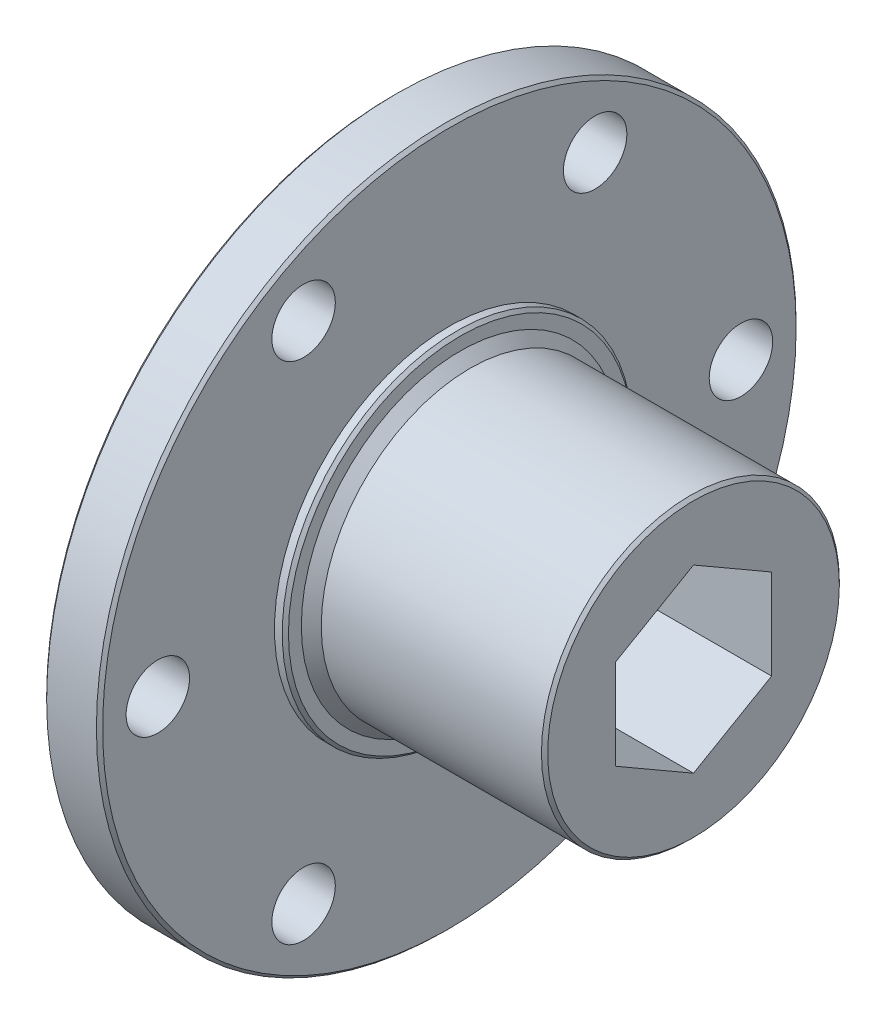
ISO-10303-21;
HEADER;
FILE_DESCRIPTION(('STEP AP214'),'2;1');
FILE_NAME('part.step','',(''),(''),'','','');
FILE_SCHEMA(('AUTOMOTIVE_DESIGN { 1 0 10303 214 1 1 1 1 }'));
ENDSEC;
DATA;
#1=APPLICATION_CONTEXT('core data for automotive mechanical design processes');
#2=APPLICATION_PROTOCOL_DEFINITION('international standard','automotive_design',2000,#1);
#3=PRODUCT_CONTEXT('',#1,'mechanical');
#4=PRODUCT('Part','Part','',(#3));
#5=PRODUCT_RELATED_PRODUCT_CATEGORY('part','',(#4));
#6=PRODUCT_DEFINITION_FORMATION('','',#4);
#7=PRODUCT_DEFINITION_CONTEXT('part definition',#1,'design');
#8=PRODUCT_DEFINITION('design','',#6,#7);
#9=PRODUCT_DEFINITION_SHAPE('','',#8);
#10=(LENGTH_UNIT() NAMED_UNIT(*) SI_UNIT(.MILLI.,.METRE.));
#11=(NAMED_UNIT(*) PLANE_ANGLE_UNIT() SI_UNIT($,.RADIAN.));
#12=(NAMED_UNIT(*) SI_UNIT($,.STERADIAN.) SOLID_ANGLE_UNIT());
#13=UNCERTAINTY_MEASURE_WITH_UNIT(LENGTH_MEASURE(1.E-05),#10,'distance_accuracy_value','');
#14=(GEOMETRIC_REPRESENTATION_CONTEXT(3) GLOBAL_UNCERTAINTY_ASSIGNED_CONTEXT((#13)) GLOBAL_UNIT_ASSIGNED_CONTEXT((#10,
#11,#12)) REPRESENTATION_CONTEXT('',''));
#15=CARTESIAN_POINT('',(0.,0.,0.));
#16=DIRECTION('',(0.,0.,1.));
#17=DIRECTION('',(1.,0.,0.));
#18=AXIS2_PLACEMENT_3D('',#15,#16,#17);
#19=CARTESIAN_POINT('',(-13.9240662460568,0.,0.));
#20=DIRECTION('',(-1.,0.,0.));
#21=DIRECTION('',(0.,0.,1.));
#22=AXIS2_PLACEMENT_3D('',#19,#20,#21);
#23=CYLINDRICAL_SURFACE('',#22,28.575);
#24=CARTESIAN_POINT('',(-18.2420662460566,0.,0.));
#25=DIRECTION('',(-1.,0.,0.));
#26=DIRECTION('',(0.,0.,1.));
#27=AXIS2_PLACEMENT_3D('',#24,#25,#26);
#28=CIRCLE('',#27,28.575);
#29=CARTESIAN_POINT('',(-18.2420662460566,0.,28.575));
#30=VERTEX_POINT('',#29);
#31=EDGE_CURVE('E177',#30,#30,#28,.F.);
#32=ORIENTED_EDGE('',*,*,#31,.T.);
#33=EDGE_LOOP('',(#32));
#34=FACE_BOUND('',#33,.T.);
#35=CARTESIAN_POINT('',(-14.1780662460569,0.,0.));
#36=DIRECTION('',(1.,0.,0.));
#37=DIRECTION('',(0.,0.,-1.));
#38=AXIS2_PLACEMENT_3D('',#35,#36,#37);
#39=CIRCLE('',#38,28.575);
#40=CARTESIAN_POINT('',(-14.1780662460569,0.,-28.575));
#41=VERTEX_POINT('',#40);
#42=EDGE_CURVE('E174',#41,#41,#39,.F.);
#43=ORIENTED_EDGE('',*,*,#42,.T.);
#44=EDGE_LOOP('',(#43));
#45=FACE_BOUND('',#44,.T.);
#46=ADVANCED_FACE('F35',(#34,#45),#23,.T.);
#47=CARTESIAN_POINT('',(-13.9240662460568,28.575,0.));
#48=DIRECTION('',(1.,0.,0.));
#49=DIRECTION('',(0.,0.,-1.));
#50=AXIS2_PLACEMENT_3D('',#47,#48,#49);
#51=PLANE('',#50);
#52=CARTESIAN_POINT('',(-13.9240662460568,0.,0.));
#53=DIRECTION('',(1.,0.,0.));
#54=DIRECTION('',(0.,0.,-1.));
#55=AXIS2_PLACEMENT_3D('',#52,#53,#54);
#56=CIRCLE('',#55,28.3209999999999);
#57=CARTESIAN_POINT('',(-13.9240662460568,0.,-28.3209999999999));
#58=VERTEX_POINT('',#57);
#59=EDGE_CURVE('E11',#58,#58,#56,.T.);
#60=ORIENTED_EDGE('',*,*,#59,.T.);
#61=EDGE_LOOP('',(#60));
#62=FACE_BOUND('',#61,.T.);
#63=CARTESIAN_POINT('',(-13.9240662460568,20.6222299276169,11.90625));
#64=DIRECTION('',(1.,0.,0.));
#65=DIRECTION('',(0.,0.,-1.));
#66=AXIS2_PLACEMENT_3D('',#63,#64,#65);
#67=CIRCLE('',#66,2.59080000000003);
#68=CARTESIAN_POINT('',(-13.9240662460568,20.6222299276169,9.31544999999998));
#69=VERTEX_POINT('',#68);
#70=EDGE_CURVE('E155',#69,#69,#67,.T.);
#71=ORIENTED_EDGE('',*,*,#70,.F.);
#72=EDGE_LOOP('',(#71));
#73=FACE_BOUND('',#72,.T.);
#74=CARTESIAN_POINT('',(-13.9240662460568,0.,-23.8125));
#75=DIRECTION('',(1.,0.,0.));
#76=DIRECTION('',(0.,0.,-1.));
#77=AXIS2_PLACEMENT_3D('',#74,#75,#76);
#78=CIRCLE('',#77,2.59080000000003);
#79=CARTESIAN_POINT('',(-13.9240662460568,0.,-26.4033));
#80=VERTEX_POINT('',#79);
#81=EDGE_CURVE('E329',#80,#80,#78,.T.);
#82=ORIENTED_EDGE('',*,*,#81,.F.);
#83=EDGE_LOOP('',(#82));
#84=FACE_BOUND('',#83,.T.);
#85=CARTESIAN_POINT('',(-13.9240662460568,-20.622229927617,11.9062499999999));
#86=DIRECTION('',(1.,0.,0.));
#87=DIRECTION('',(0.,0.,-1.));
#88=AXIS2_PLACEMENT_3D('',#85,#86,#87);
#89=CIRCLE('',#88,2.59080000000003);
#90=CARTESIAN_POINT('',(-13.9240662460568,-20.622229927617,9.31544999999992));
#91=VERTEX_POINT('',#90);
#92=EDGE_CURVE('E333',#91,#91,#89,.T.);
#93=ORIENTED_EDGE('',*,*,#92,.F.);
#94=EDGE_LOOP('',(#93));
#95=FACE_BOUND('',#94,.T.);
#96=CARTESIAN_POINT('',(-13.9240662460568,-20.6222299276169,-11.90625));
#97=DIRECTION('',(1.,0.,0.));
#98=DIRECTION('',(0.,0.,-1.));
#99=AXIS2_PLACEMENT_3D('',#96,#97,#98);
#100=CIRCLE('',#99,2.59080000000003);
#101=CARTESIAN_POINT('',(-13.9240662460568,-20.6222299276169,-14.4970500000001));
#102=VERTEX_POINT('',#101);
#103=EDGE_CURVE('E337',#102,#102,#100,.T.);
#104=ORIENTED_EDGE('',*,*,#103,.F.);
#105=EDGE_LOOP('',(#104));
#106=FACE_BOUND('',#105,.T.);
#107=CARTESIAN_POINT('',(-13.9240662460568,20.622229927617,-11.90625));
#108=DIRECTION('',(1.,0.,0.));
#109=DIRECTION('',(0.,0.,-1.));
#110=AXIS2_PLACEMENT_3D('',#107,#108,#109);
#111=CIRCLE('',#110,2.59080000000003);
#112=CARTESIAN_POINT('',(-13.9240662460568,20.622229927617,-14.49705));
#113=VERTEX_POINT('',#112);
#114=EDGE_CURVE('E341',#113,#113,#111,.T.);
#115=ORIENTED_EDGE('',*,*,#114,.F.);
#116=EDGE_LOOP('',(#115));
#117=FACE_BOUND('',#116,.T.);
#118=CARTESIAN_POINT('',(-13.9240662460568,0.,23.8125));
#119=DIRECTION('',(1.,0.,0.));
#120=DIRECTION('',(0.,0.,-1.));
#121=AXIS2_PLACEMENT_3D('',#118,#119,#120);
#122=CIRCLE('',#121,2.59080000000003);
#123=CARTESIAN_POINT('',(-13.9240662460568,0.,21.2217));
#124=VERTEX_POINT('',#123);
#125=EDGE_CURVE('E112',#124,#124,#122,.T.);
#126=ORIENTED_EDGE('',*,*,#125,.F.);
#127=EDGE_LOOP('',(#126));
#128=FACE_BOUND('',#127,.T.);
#129=CARTESIAN_POINT('',(-13.9240662460568,0.,0.));
#130=DIRECTION('',(1.,0.,0.));
#131=DIRECTION('',(0.,0.,-1.));
#132=AXIS2_PLACEMENT_3D('',#129,#130,#131);
#133=CIRCLE('',#132,14.2875);
#134=CARTESIAN_POINT('',(-13.9240662460568,0.,-14.2875));
#135=VERTEX_POINT('',#134);
#136=EDGE_CURVE('E151',#135,#135,#133,.T.);
#137=ORIENTED_EDGE('',*,*,#136,.F.);
#138=EDGE_LOOP('',(#137));
#139=FACE_BOUND('',#138,.T.);
#140=ADVANCED_FACE('F212',(#62,#73,#84,#95,#106,#117,#128,#139),#51,.T.);
#141=CARTESIAN_POINT('',(-18.4960662460568,0.,0.));
#142=DIRECTION('',(-1.,0.,0.));
#143=DIRECTION('',(0.,0.,1.));
#144=AXIS2_PLACEMENT_3D('',#141,#142,#143);
#145=PLANE('',#144);
#146=CARTESIAN_POINT('',(-18.4960662460568,0.,0.));
#147=DIRECTION('',(-1.,0.,0.));
#148=DIRECTION('',(0.,0.,1.));
#149=AXIS2_PLACEMENT_3D('',#146,#147,#148);
#150=CIRCLE('',#149,28.3209999999999);
#151=CARTESIAN_POINT('',(-18.4960662460568,0.,28.3209999999999));
#152=VERTEX_POINT('',#151);
#153=EDGE_CURVE('E171',#152,#152,#150,.T.);
#154=ORIENTED_EDGE('',*,*,#153,.T.);
#155=EDGE_LOOP('',(#154));
#156=FACE_BOUND('',#155,.T.);
#157=CARTESIAN_POINT('',(-18.4960662460568,20.6222299276169,11.90625));
#158=DIRECTION('',(-1.,0.,0.));
#159=DIRECTION('',(0.,0.,1.));
#160=AXIS2_PLACEMENT_3D('',#157,#158,#159);
#161=CIRCLE('',#160,2.59080000000003);
#162=CARTESIAN_POINT('',(-18.4960662460568,20.6222299276169,14.49705));
#163=VERTEX_POINT('',#162);
#164=EDGE_CURVE('E159',#163,#163,#161,.T.);
#165=ORIENTED_EDGE('',*,*,#164,.F.);
#166=EDGE_LOOP('',(#165));
#167=FACE_BOUND('',#166,.T.);
#168=CARTESIAN_POINT('',(-18.4960662460568,0.,-23.8125));
#169=DIRECTION('',(-1.,0.,0.));
#170=DIRECTION('',(0.,0.,1.));
#171=AXIS2_PLACEMENT_3D('',#168,#169,#170);
#172=CIRCLE('',#171,2.59080000000003);
#173=CARTESIAN_POINT('',(-18.4960662460568,0.,-21.2217));
#174=VERTEX_POINT('',#173);
#175=EDGE_CURVE('E158',#174,#174,#172,.T.);
#176=ORIENTED_EDGE('',*,*,#175,.F.);
#177=EDGE_LOOP('',(#176));
#178=FACE_BOUND('',#177,.T.);
#179=CARTESIAN_POINT('',(-18.4960662460568,-20.622229927617,11.9062499999999));
#180=DIRECTION('',(-1.,0.,0.));
#181=DIRECTION('',(0.,0.,1.));
#182=AXIS2_PLACEMENT_3D('',#179,#180,#181);
#183=CIRCLE('',#182,2.59080000000003);
#184=CARTESIAN_POINT('',(-18.4960662460568,-20.622229927617,14.49705));
#185=VERTEX_POINT('',#184);
#186=EDGE_CURVE('E252',#185,#185,#183,.T.);
#187=ORIENTED_EDGE('',*,*,#186,.F.);
#188=EDGE_LOOP('',(#187));
#189=FACE_BOUND('',#188,.T.);
#190=CARTESIAN_POINT('',(-18.4960662460568,-20.6222299276169,-11.90625));
#191=DIRECTION('',(-1.,0.,0.));
#192=DIRECTION('',(0.,0.,1.));
#193=AXIS2_PLACEMENT_3D('',#190,#191,#192);
#194=CIRCLE('',#193,2.59080000000003);
#195=CARTESIAN_POINT('',(-18.4960662460568,-20.6222299276169,-9.31545000000002));
#196=VERTEX_POINT('',#195);
#197=EDGE_CURVE('E256',#196,#196,#194,.T.);
#198=ORIENTED_EDGE('',*,*,#197,.F.);
#199=EDGE_LOOP('',(#198));
#200=FACE_BOUND('',#199,.T.);
#201=CARTESIAN_POINT('',(-18.4960662460568,20.622229927617,-11.90625));
#202=DIRECTION('',(-1.,0.,0.));
#203=DIRECTION('',(0.,0.,1.));
#204=AXIS2_PLACEMENT_3D('',#201,#202,#203);
#205=CIRCLE('',#204,2.59080000000003);
#206=CARTESIAN_POINT('',(-18.4960662460568,20.622229927617,-9.31544999999995));
#207=VERTEX_POINT('',#206);
#208=EDGE_CURVE('E260',#207,#207,#205,.T.);
#209=ORIENTED_EDGE('',*,*,#208,.F.);
#210=EDGE_LOOP('',(#209));
#211=FACE_BOUND('',#210,.T.);
#212=CARTESIAN_POINT('',(-18.4960662460568,0.,23.8125));
#213=DIRECTION('',(-1.,0.,0.));
#214=DIRECTION('',(0.,0.,1.));
#215=AXIS2_PLACEMENT_3D('',#212,#213,#214);
#216=CIRCLE('',#215,2.59080000000003);
#217=CARTESIAN_POINT('',(-18.4960662460568,0.,26.4033));
#218=VERTEX_POINT('',#217);
#219=EDGE_CURVE('E264',#218,#218,#216,.T.);
#220=ORIENTED_EDGE('',*,*,#219,.F.);
#221=EDGE_LOOP('',(#220));
#222=FACE_BOUND('',#221,.T.);
#223=CARTESIAN_POINT('',(-18.4960662460568,0.,0.));
#224=DIRECTION('',(-1.,0.,0.));
#225=DIRECTION('',(0.,0.,1.));
#226=AXIS2_PLACEMENT_3D('',#223,#224,#225);
#227=CIRCLE('',#226,14.2875);
#228=CARTESIAN_POINT('',(-18.4960662460568,0.,14.2875));
#229=VERTEX_POINT('',#228);
#230=EDGE_CURVE('E135',#229,#229,#227,.T.);
#231=ORIENTED_EDGE('',*,*,#230,.F.);
#232=EDGE_LOOP('',(#231));
#233=FACE_BOUND('',#232,.T.);
#234=ADVANCED_FACE('F218',(#156,#167,#178,#189,#200,#211,#222,#233),#145,.T.);
#235=CARTESIAN_POINT('',(-13.0350662460568,0.,0.));
#236=DIRECTION('',(-1.,0.,0.));
#237=DIRECTION('',(0.,0.,1.));
#238=AXIS2_PLACEMENT_3D('',#235,#236,#237);
#239=CYLINDRICAL_SURFACE('',#238,14.2875);
#240=CARTESIAN_POINT('',(-13.2890662460569,0.,0.));
#241=DIRECTION('',(1.,0.,0.));
#242=DIRECTION('',(0.,0.,-1.));
#243=AXIS2_PLACEMENT_3D('',#240,#241,#242);
#244=CIRCLE('',#243,14.2875);
#245=CARTESIAN_POINT('',(-13.2890662460569,0.,-14.2875));
#246=VERTEX_POINT('',#245);
#247=EDGE_CURVE('E43',#246,#246,#244,.F.);
#248=ORIENTED_EDGE('',*,*,#247,.T.);
#249=EDGE_LOOP('',(#248));
#250=FACE_BOUND('',#249,.T.);
#251=ORIENTED_EDGE('',*,*,#136,.T.);
#252=EDGE_LOOP('',(#251));
#253=FACE_BOUND('',#252,.T.);
#254=ADVANCED_FACE('F185',(#250,#253),#239,.T.);
#255=CARTESIAN_POINT('',(-13.0350662460568,0.,0.));
#256=DIRECTION('',(1.,0.,0.));
#257=DIRECTION('',(0.,0.,-1.));
#258=AXIS2_PLACEMENT_3D('',#255,#256,#257);
#259=PLANE('',#258);
#260=CARTESIAN_POINT('',(-13.0350662460568,0.,0.));
#261=DIRECTION('',(1.,0.,0.));
#262=DIRECTION('',(0.,0.,-1.));
#263=AXIS2_PLACEMENT_3D('',#260,#261,#262);
#264=CIRCLE('',#263,14.0334999999999);
#265=CARTESIAN_POINT('',(-13.0350662460568,0.,-14.0334999999999));
#266=VERTEX_POINT('',#265);
#267=EDGE_CURVE('E180',#266,#266,#264,.T.);
#268=ORIENTED_EDGE('',*,*,#267,.T.);
#269=EDGE_LOOP('',(#268));
#270=FACE_BOUND('',#269,.T.);
#271=CARTESIAN_POINT('',(-13.0350662460568,0.,0.));
#272=DIRECTION('',(1.,0.,0.));
#273=DIRECTION('',(0.,0.,-1.));
#274=AXIS2_PLACEMENT_3D('',#271,#272,#273);
#275=CIRCLE('',#274,12.9794);
#276=CARTESIAN_POINT('',(-13.0350662460568,0.,-12.9794));
#277=VERTEX_POINT('',#276);
#278=EDGE_CURVE('E145',#277,#277,#275,.T.);
#279=ORIENTED_EDGE('',*,*,#278,.F.);
#280=EDGE_LOOP('',(#279));
#281=FACE_BOUND('',#280,.T.);
#282=ADVANCED_FACE('F194',(#270,#281),#259,.T.);
#283=CARTESIAN_POINT('',(-13.0350662460568,0.,0.));
#284=DIRECTION('',(-1.,0.,0.));
#285=DIRECTION('',(0.,0.,-1.));
#286=AXIS2_PLACEMENT_3D('',#283,#284,#285);
#287=CONICAL_SURFACE('',#286,12.9794,0.785398163397434);
#288=CARTESIAN_POINT('',(-12.2222662460567,0.,0.));
#289=DIRECTION('',(1.,0.,0.));
#290=DIRECTION('',(0.,0.,-1.));
#291=AXIS2_PLACEMENT_3D('',#288,#289,#290);
#292=CIRCLE('',#291,12.1666);
#293=CARTESIAN_POINT('',(-12.2222662460567,0.,-12.1666));
#294=VERTEX_POINT('',#293);
#295=EDGE_CURVE('E148',#294,#294,#292,.T.);
#296=ORIENTED_EDGE('',*,*,#295,.F.);
#297=EDGE_LOOP('',(#296));
#298=FACE_BOUND('',#297,.T.);
#299=ORIENTED_EDGE('',*,*,#278,.T.);
#300=EDGE_LOOP('',(#299));
#301=FACE_BOUND('',#300,.T.);
#302=ADVANCED_FACE('F197',(#298,#301),#287,.T.);
#303=CARTESIAN_POINT('',(6.01493375394323,0.,0.));
#304=DIRECTION('',(-1.,0.,0.));
#305=DIRECTION('',(0.,0.,1.));
#306=AXIS2_PLACEMENT_3D('',#303,#304,#305);
#307=CYLINDRICAL_SURFACE('',#306,12.1666);
#308=CARTESIAN_POINT('',(5.76093375394317,0.,0.));
#309=DIRECTION('',(1.,0.,0.));
#310=DIRECTION('',(0.,0.,-1.));
#311=AXIS2_PLACEMENT_3D('',#308,#309,#310);
#312=CIRCLE('',#311,12.1666);
#313=CARTESIAN_POINT('',(5.76093375394317,0.,-12.1666));
#314=VERTEX_POINT('',#313);
#315=EDGE_CURVE('E168',#314,#314,#312,.F.);
#316=ORIENTED_EDGE('',*,*,#315,.T.);
#317=EDGE_LOOP('',(#316));
#318=FACE_BOUND('',#317,.T.);
#319=ORIENTED_EDGE('',*,*,#295,.T.);
#320=EDGE_LOOP('',(#319));
#321=FACE_BOUND('',#320,.T.);
#322=ADVANCED_FACE('F202',(#318,#321),#307,.T.);
#323=CARTESIAN_POINT('',(6.01493375394323,0.,0.));
#324=DIRECTION('',(1.,0.,0.));
#325=DIRECTION('',(0.,0.,-1.));
#326=AXIS2_PLACEMENT_3D('',#323,#324,#325);
#327=PLANE('',#326);
#328=CARTESIAN_POINT('',(6.01493375394323,0.,0.));
#329=DIRECTION('',(1.,0.,0.));
#330=DIRECTION('',(0.,0.,-1.));
#331=AXIS2_PLACEMENT_3D('',#328,#329,#330);
#332=CIRCLE('',#331,11.9125999999999);
#333=CARTESIAN_POINT('',(6.01493375394323,0.,-11.9125999999999));
#334=VERTEX_POINT('',#333);
#335=EDGE_CURVE('E165',#334,#334,#332,.T.);
#336=ORIENTED_EDGE('',*,*,#335,.T.);
#337=EDGE_LOOP('',(#336));
#338=FACE_BOUND('',#337,.T.);
#339=DIRECTION('',(0.,0.500000000000001,-0.866025403784438));
#340=VECTOR('',#339,1.);
#341=CARTESIAN_POINT('',(6.01493375394323,3.68081890619155,6.3754));
#342=LINE('',#341,#340);
#343=CARTESIAN_POINT('',(6.01493375394323,3.68081890619155,6.3754));
#344=VERTEX_POINT('',#343);
#345=CARTESIAN_POINT('',(6.01493375394323,7.3616578123831,0.));
#346=VERTEX_POINT('',#345);
#347=EDGE_CURVE('E90',#344,#346,#342,.T.);
#348=ORIENTED_EDGE('',*,*,#347,.T.);
#349=DIRECTION('',(0.,-0.500000000000001,-0.866025403784438));
#350=VECTOR('',#349,1.);
#351=CARTESIAN_POINT('',(6.01493375394323,7.3616578123831,0.));
#352=LINE('',#351,#350);
#353=CARTESIAN_POINT('',(6.01493375394323,3.68081890619154,-6.37539999999999));
#354=VERTEX_POINT('',#353);
#355=EDGE_CURVE('E99',#346,#354,#352,.T.);
#356=ORIENTED_EDGE('',*,*,#355,.T.);
#357=DIRECTION('',(0.,-1.,0.));
#358=VECTOR('',#357,1.);
#359=CARTESIAN_POINT('',(6.01493375394323,3.68081890619155,-6.37539999999999));
#360=LINE('',#359,#358);
#361=CARTESIAN_POINT('',(6.01493375394323,-3.68085890619153,-6.37539999999999));
#362=VERTEX_POINT('',#361);
#363=EDGE_CURVE('E50',#354,#362,#360,.T.);
#364=ORIENTED_EDGE('',*,*,#363,.T.);
#365=DIRECTION('',(0.,-0.500000000000001,0.866025403784438));
#366=VECTOR('',#365,1.);
#367=CARTESIAN_POINT('',(6.01493375394323,-3.68085890619153,-6.37539999999999));
#368=LINE('',#367,#366);
#369=CARTESIAN_POINT('',(6.01493375394323,-7.36169781238308,0.));
#370=VERTEX_POINT('',#369);
#371=EDGE_CURVE('E116',#362,#370,#368,.T.);
#372=ORIENTED_EDGE('',*,*,#371,.T.);
#373=DIRECTION('',(0.,0.500000000000001,0.866025403784438));
#374=VECTOR('',#373,1.);
#375=CARTESIAN_POINT('',(6.01493375394323,-7.36169781238308,0.));
#376=LINE('',#375,#374);
#377=CARTESIAN_POINT('',(6.01493375394323,-3.68085890619153,6.3754));
#378=VERTEX_POINT('',#377);
#379=EDGE_CURVE('E119',#370,#378,#376,.T.);
#380=ORIENTED_EDGE('',*,*,#379,.T.);
#381=DIRECTION('',(0.,1.,0.));
#382=VECTOR('',#381,1.);
#383=CARTESIAN_POINT('',(6.01493375394323,-3.68085890619153,6.3754));
#384=LINE('',#383,#382);
#385=EDGE_CURVE('E96',#378,#344,#384,.T.);
#386=ORIENTED_EDGE('',*,*,#385,.T.);
#387=EDGE_LOOP('',(#348,#356,#364,#372,#380,#386));
#388=FACE_BOUND('',#387,.T.);
#389=ADVANCED_FACE('F103',(#338,#388),#327,.T.);
#390=CARTESIAN_POINT('',(-19.3850662460568,0.,0.));
#391=DIRECTION('',(1.,0.,0.));
#392=DIRECTION('',(0.,0.,-1.));
#393=AXIS2_PLACEMENT_3D('',#390,#391,#392);
#394=CYLINDRICAL_SURFACE('',#393,14.2875);
#395=CARTESIAN_POINT('',(-19.1310662460567,0.,0.));
#396=DIRECTION('',(-1.,0.,0.));
#397=DIRECTION('',(0.,0.,1.));
#398=AXIS2_PLACEMENT_3D('',#395,#396,#397);
#399=CIRCLE('',#398,14.2875);
#400=CARTESIAN_POINT('',(-19.1310662460567,0.,14.2875));
#401=VERTEX_POINT('',#400);
#402=EDGE_CURVE('E162',#401,#401,#399,.F.);
#403=ORIENTED_EDGE('',*,*,#402,.T.);
#404=EDGE_LOOP('',(#403));
#405=FACE_BOUND('',#404,.T.);
#406=ORIENTED_EDGE('',*,*,#230,.T.);
#407=EDGE_LOOP('',(#406));
#408=FACE_BOUND('',#407,.T.);
#409=ADVANCED_FACE('F267',(#405,#408),#394,.T.);
#410=CARTESIAN_POINT('',(-19.3850662460568,0.,0.));
#411=DIRECTION('',(-1.,0.,0.));
#412=DIRECTION('',(0.,0.,1.));
#413=AXIS2_PLACEMENT_3D('',#410,#411,#412);
#414=PLANE('',#413);
#415=CARTESIAN_POINT('',(-19.3850662460568,0.,0.));
#416=DIRECTION('',(-1.,0.,0.));
#417=DIRECTION('',(0.,0.,1.));
#418=AXIS2_PLACEMENT_3D('',#415,#416,#417);
#419=CIRCLE('',#418,14.0334999999999);
#420=CARTESIAN_POINT('',(-19.3850662460568,0.,14.0334999999999));
#421=VERTEX_POINT('',#420);
#422=EDGE_CURVE('E154',#421,#421,#419,.T.);
#423=ORIENTED_EDGE('',*,*,#422,.T.);
#424=EDGE_LOOP('',(#423));
#425=FACE_BOUND('',#424,.T.);
#426=DIRECTION('',(0.,0.500000000000001,-0.866025403784438));
#427=VECTOR('',#426,1.);
#428=CARTESIAN_POINT('',(-19.3850662460568,3.68081890619155,6.3754));
#429=LINE('',#428,#427);
#430=CARTESIAN_POINT('',(-19.3850662460568,3.68081890619155,6.3754));
#431=VERTEX_POINT('',#430);
#432=CARTESIAN_POINT('',(-19.3850662460568,7.36165781238309,0.));
#433=VERTEX_POINT('',#432);
#434=EDGE_CURVE('E58',#431,#433,#429,.T.);
#435=ORIENTED_EDGE('',*,*,#434,.F.);
#436=DIRECTION('',(0.,1.,0.));
#437=VECTOR('',#436,1.);
#438=CARTESIAN_POINT('',(-19.3850662460568,-3.68085890619153,6.3754));
#439=LINE('',#438,#437);
#440=CARTESIAN_POINT('',(-19.3850662460568,-3.68085890619153,6.3754));
#441=VERTEX_POINT('',#440);
#442=EDGE_CURVE('E106',#441,#431,#439,.T.);
#443=ORIENTED_EDGE('',*,*,#442,.F.);
#444=DIRECTION('',(0.,0.500000000000001,0.866025403784438));
#445=VECTOR('',#444,1.);
#446=CARTESIAN_POINT('',(-19.3850662460568,-7.36169781238308,0.));
#447=LINE('',#446,#445);
#448=CARTESIAN_POINT('',(-19.3850662460568,-7.36169781238308,0.));
#449=VERTEX_POINT('',#448);
#450=EDGE_CURVE('E109',#449,#441,#447,.T.);
#451=ORIENTED_EDGE('',*,*,#450,.F.);
#452=DIRECTION('',(0.,-0.500000000000001,0.866025403784438));
#453=VECTOR('',#452,1.);
#454=CARTESIAN_POINT('',(-19.3850662460568,-3.68085890619153,-6.37539999999999));
#455=LINE('',#454,#453);
#456=CARTESIAN_POINT('',(-19.3850662460568,-3.68085890619153,-6.37539999999999));
#457=VERTEX_POINT('',#456);
#458=EDGE_CURVE('E128',#457,#449,#455,.T.);
#459=ORIENTED_EDGE('',*,*,#458,.F.);
#460=DIRECTION('',(0.,-1.,0.));
#461=VECTOR('',#460,1.);
#462=CARTESIAN_POINT('',(-19.3850662460568,3.68081890619155,-6.37539999999999));
#463=LINE('',#462,#461);
#464=CARTESIAN_POINT('',(-19.3850662460568,3.68081890619155,-6.37539999999999));
#465=VERTEX_POINT('',#464);
#466=EDGE_CURVE('E125',#465,#457,#463,.T.);
#467=ORIENTED_EDGE('',*,*,#466,.F.);
#468=DIRECTION('',(0.,-0.500000000000001,-0.866025403784438));
#469=VECTOR('',#468,1.);
#470=CARTESIAN_POINT('',(-19.3850662460568,7.3616578123831,0.));
#471=LINE('',#470,#469);
#472=EDGE_CURVE('E123',#433,#465,#471,.T.);
#473=ORIENTED_EDGE('',*,*,#472,.F.);
#474=EDGE_LOOP('',(#435,#443,#451,#459,#467,#473));
#475=FACE_BOUND('',#474,.T.);
#476=ADVANCED_FACE('F269',(#425,#475),#414,.T.);
#477=CARTESIAN_POINT('',(6.01493375394323,3.68081890619155,6.3754));
#478=DIRECTION('',(0.,0.866025403784438,0.500000000000001));
#479=DIRECTION('',(0.,-0.500000000000001,0.866025403784438));
#480=AXIS2_PLACEMENT_3D('',#477,#478,#479);
#481=PLANE('',#480);
#482=ORIENTED_EDGE('',*,*,#434,.T.);
#483=DIRECTION('',(-1.,0.,0.));
#484=VECTOR('',#483,1.);
#485=CARTESIAN_POINT('',(6.01493375394323,7.3616578123831,0.));
#486=LINE('',#485,#484);
#487=EDGE_CURVE('E86',#346,#433,#486,.T.);
#488=ORIENTED_EDGE('',*,*,#487,.F.);
#489=ORIENTED_EDGE('',*,*,#347,.F.);
#490=DIRECTION('',(-1.,0.,0.));
#491=VECTOR('',#490,1.);
#492=CARTESIAN_POINT('',(6.01493375394323,3.68081890619155,6.3754));
#493=LINE('',#492,#491);
#494=EDGE_CURVE('E133',#344,#431,#493,.T.);
#495=ORIENTED_EDGE('',*,*,#494,.T.);
#496=EDGE_LOOP('',(#482,#488,#489,#495));
#497=FACE_BOUND('',#496,.T.);
#498=ADVANCED_FACE('F88',(#497),#481,.F.);
#499=CARTESIAN_POINT('',(6.01493375394323,-3.68085890619153,6.3754));
#500=DIRECTION('',(0.,0.,1.));
#501=DIRECTION('',(0.,-1.,0.));
#502=AXIS2_PLACEMENT_3D('',#499,#500,#501);
#503=PLANE('',#502);
#504=ORIENTED_EDGE('',*,*,#442,.T.);
#505=ORIENTED_EDGE('',*,*,#494,.F.);
#506=ORIENTED_EDGE('',*,*,#385,.F.);
#507=DIRECTION('',(-1.,0.,0.));
#508=VECTOR('',#507,1.);
#509=CARTESIAN_POINT('',(6.01493375394323,-3.68085890619153,6.3754));
#510=LINE('',#509,#508);
#511=EDGE_CURVE('E136',#378,#441,#510,.T.);
#512=ORIENTED_EDGE('',*,*,#511,.T.);
#513=EDGE_LOOP('',(#504,#505,#506,#512));
#514=FACE_BOUND('',#513,.T.);
#515=ADVANCED_FACE('F283',(#514),#503,.F.);
#516=CARTESIAN_POINT('',(6.01493375394323,-7.36169781238308,0.));
#517=DIRECTION('',(0.,-0.866025403784438,0.500000000000001));
#518=DIRECTION('',(0.,-0.500000000000001,-0.866025403784438));
#519=AXIS2_PLACEMENT_3D('',#516,#517,#518);
#520=PLANE('',#519);
#521=ORIENTED_EDGE('',*,*,#450,.T.);
#522=ORIENTED_EDGE('',*,*,#511,.F.);
#523=ORIENTED_EDGE('',*,*,#379,.F.);
#524=DIRECTION('',(-1.,0.,0.));
#525=VECTOR('',#524,1.);
#526=CARTESIAN_POINT('',(6.01493375394323,-7.36169781238308,0.));
#527=LINE('',#526,#525);
#528=EDGE_CURVE('E138',#370,#449,#527,.T.);
#529=ORIENTED_EDGE('',*,*,#528,.T.);
#530=EDGE_LOOP('',(#521,#522,#523,#529));
#531=FACE_BOUND('',#530,.T.);
#532=ADVANCED_FACE('F293',(#531),#520,.F.);
#533=CARTESIAN_POINT('',(6.01493375394323,-3.68085890619153,-6.37539999999999));
#534=DIRECTION('',(0.,-0.866025403784438,-0.500000000000001));
#535=DIRECTION('',(0.,0.500000000000001,-0.866025403784438));
#536=AXIS2_PLACEMENT_3D('',#533,#534,#535);
#537=PLANE('',#536);
#538=ORIENTED_EDGE('',*,*,#458,.T.);
#539=ORIENTED_EDGE('',*,*,#528,.F.);
#540=ORIENTED_EDGE('',*,*,#371,.F.);
#541=DIRECTION('',(-1.,0.,0.));
#542=VECTOR('',#541,1.);
#543=CARTESIAN_POINT('',(6.01493375394323,-3.68085890619153,-6.37539999999999));
#544=LINE('',#543,#542);
#545=EDGE_CURVE('E140',#362,#457,#544,.T.);
#546=ORIENTED_EDGE('',*,*,#545,.T.);
#547=EDGE_LOOP('',(#538,#539,#540,#546));
#548=FACE_BOUND('',#547,.T.);
#549=ADVANCED_FACE('F290',(#548),#537,.F.);
#550=CARTESIAN_POINT('',(6.01493375394323,3.68081890619155,-6.37539999999999));
#551=DIRECTION('',(0.,0.,-1.));
#552=DIRECTION('',(0.,1.,0.));
#553=AXIS2_PLACEMENT_3D('',#550,#551,#552);
#554=PLANE('',#553);
#555=ORIENTED_EDGE('',*,*,#466,.T.);
#556=ORIENTED_EDGE('',*,*,#545,.F.);
#557=ORIENTED_EDGE('',*,*,#363,.F.);
#558=DIRECTION('',(-1.,0.,0.));
#559=VECTOR('',#558,1.);
#560=CARTESIAN_POINT('',(6.01493375394323,3.68081890619155,-6.37539999999999));
#561=LINE('',#560,#559);
#562=EDGE_CURVE('E95',#354,#465,#561,.T.);
#563=ORIENTED_EDGE('',*,*,#562,.T.);
#564=EDGE_LOOP('',(#555,#556,#557,#563));
#565=FACE_BOUND('',#564,.T.);
#566=ADVANCED_FACE('F287',(#565),#554,.F.);
#567=CARTESIAN_POINT('',(6.01493375394323,7.3616578123831,0.));
#568=DIRECTION('',(0.,0.866025403784438,-0.500000000000001));
#569=DIRECTION('',(0.,0.500000000000001,0.866025403784438));
#570=AXIS2_PLACEMENT_3D('',#567,#568,#569);
#571=PLANE('',#570);
#572=ORIENTED_EDGE('',*,*,#472,.T.);
#573=ORIENTED_EDGE('',*,*,#562,.F.);
#574=ORIENTED_EDGE('',*,*,#355,.F.);
#575=ORIENTED_EDGE('',*,*,#487,.T.);
#576=EDGE_LOOP('',(#572,#573,#574,#575));
#577=FACE_BOUND('',#576,.T.);
#578=ADVANCED_FACE('F100',(#577),#571,.F.);
#579=CARTESIAN_POINT('',(-18.4960662460568,0.,23.8125));
#580=DIRECTION('',(-1.,0.,0.));
#581=DIRECTION('',(0.,0.,1.));
#582=AXIS2_PLACEMENT_3D('',#579,#580,#581);
#583=CYLINDRICAL_SURFACE('',#582,2.59080000000003);
#584=ORIENTED_EDGE('',*,*,#125,.T.);
#585=EDGE_LOOP('',(#584));
#586=FACE_BOUND('',#585,.T.);
#587=ORIENTED_EDGE('',*,*,#219,.T.);
#588=EDGE_LOOP('',(#587));
#589=FACE_BOUND('',#588,.T.);
#590=ADVANCED_FACE('F286',(#586,#589),#583,.F.);
#591=CARTESIAN_POINT('',(-18.4960662460568,20.622229927617,-11.90625));
#592=DIRECTION('',(-1.,0.,0.));
#593=DIRECTION('',(0.,0.,1.));
#594=AXIS2_PLACEMENT_3D('',#591,#592,#593);
#595=CYLINDRICAL_SURFACE('',#594,2.59080000000003);
#596=ORIENTED_EDGE('',*,*,#114,.T.);
#597=EDGE_LOOP('',(#596));
#598=FACE_BOUND('',#597,.T.);
#599=ORIENTED_EDGE('',*,*,#208,.T.);
#600=EDGE_LOOP('',(#599));
#601=FACE_BOUND('',#600,.T.);
#602=ADVANCED_FACE('F303',(#598,#601),#595,.F.);
#603=CARTESIAN_POINT('',(-18.4960662460568,-20.6222299276169,-11.90625));
#604=DIRECTION('',(-1.,0.,0.));
#605=DIRECTION('',(0.,0.,1.));
#606=AXIS2_PLACEMENT_3D('',#603,#604,#605);
#607=CYLINDRICAL_SURFACE('',#606,2.59080000000003);
#608=ORIENTED_EDGE('',*,*,#103,.T.);
#609=EDGE_LOOP('',(#608));
#610=FACE_BOUND('',#609,.T.);
#611=ORIENTED_EDGE('',*,*,#197,.T.);
#612=EDGE_LOOP('',(#611));
#613=FACE_BOUND('',#612,.T.);
#614=ADVANCED_FACE('F307',(#610,#613),#607,.F.);
#615=CARTESIAN_POINT('',(-18.4960662460568,-20.622229927617,11.9062499999999));
#616=DIRECTION('',(-1.,0.,0.));
#617=DIRECTION('',(0.,0.,1.));
#618=AXIS2_PLACEMENT_3D('',#615,#616,#617);
#619=CYLINDRICAL_SURFACE('',#618,2.59080000000003);
#620=ORIENTED_EDGE('',*,*,#92,.T.);
#621=EDGE_LOOP('',(#620));
#622=FACE_BOUND('',#621,.T.);
#623=ORIENTED_EDGE('',*,*,#186,.T.);
#624=EDGE_LOOP('',(#623));
#625=FACE_BOUND('',#624,.T.);
#626=ADVANCED_FACE('F311',(#622,#625),#619,.F.);
#627=CARTESIAN_POINT('',(-18.4960662460568,0.,-23.8125));
#628=DIRECTION('',(-1.,0.,0.));
#629=DIRECTION('',(0.,0.,1.));
#630=AXIS2_PLACEMENT_3D('',#627,#628,#629);
#631=CYLINDRICAL_SURFACE('',#630,2.59080000000003);
#632=ORIENTED_EDGE('',*,*,#81,.T.);
#633=EDGE_LOOP('',(#632));
#634=FACE_BOUND('',#633,.T.);
#635=ORIENTED_EDGE('',*,*,#175,.T.);
#636=EDGE_LOOP('',(#635));
#637=FACE_BOUND('',#636,.T.);
#638=ADVANCED_FACE('F315',(#634,#637),#631,.F.);
#639=CARTESIAN_POINT('',(-18.4960662460568,20.6222299276169,11.90625));
#640=DIRECTION('',(-1.,0.,0.));
#641=DIRECTION('',(0.,0.,1.));
#642=AXIS2_PLACEMENT_3D('',#639,#640,#641);
#643=CYLINDRICAL_SURFACE('',#642,2.59080000000003);
#644=ORIENTED_EDGE('',*,*,#70,.T.);
#645=EDGE_LOOP('',(#644));
#646=FACE_BOUND('',#645,.T.);
#647=ORIENTED_EDGE('',*,*,#164,.T.);
#648=EDGE_LOOP('',(#647));
#649=FACE_BOUND('',#648,.T.);
#650=ADVANCED_FACE('F228',(#646,#649),#643,.F.);
#651=CARTESIAN_POINT('',(-19.3850662460568,0.,0.));
#652=DIRECTION('',(1.,0.,0.));
#653=DIRECTION('',(0.,0.,-1.));
#654=AXIS2_PLACEMENT_3D('',#651,#652,#653);
#655=CONICAL_SURFACE('',#654,14.0334999999999,0.785398163397448);
#656=ORIENTED_EDGE('',*,*,#402,.F.);
#657=EDGE_LOOP('',(#656));
#658=FACE_BOUND('',#657,.T.);
#659=ORIENTED_EDGE('',*,*,#422,.F.);
#660=EDGE_LOOP('',(#659));
#661=FACE_BOUND('',#660,.T.);
#662=ADVANCED_FACE('F224',(#658,#661),#655,.T.);
#663=CARTESIAN_POINT('',(6.01493375394323,0.,0.));
#664=DIRECTION('',(-1.,0.,0.));
#665=DIRECTION('',(0.,0.,1.));
#666=AXIS2_PLACEMENT_3D('',#663,#664,#665);
#667=CONICAL_SURFACE('',#666,11.9125999999999,0.785398163397452);
#668=ORIENTED_EDGE('',*,*,#315,.F.);
#669=EDGE_LOOP('',(#668));
#670=FACE_BOUND('',#669,.T.);
#671=ORIENTED_EDGE('',*,*,#335,.F.);
#672=EDGE_LOOP('',(#671));
#673=FACE_BOUND('',#672,.T.);
#674=ADVANCED_FACE('F227',(#670,#673),#667,.T.);
#675=CARTESIAN_POINT('',(-18.4960662460568,0.,0.));
#676=DIRECTION('',(1.,0.,0.));
#677=DIRECTION('',(0.,0.,-1.));
#678=AXIS2_PLACEMENT_3D('',#675,#676,#677);
#679=CONICAL_SURFACE('',#678,28.3209999999999,0.785398163397455);
#680=ORIENTED_EDGE('',*,*,#31,.F.);
#681=EDGE_LOOP('',(#680));
#682=FACE_BOUND('',#681,.T.);
#683=ORIENTED_EDGE('',*,*,#153,.F.);
#684=EDGE_LOOP('',(#683));
#685=FACE_BOUND('',#684,.T.);
#686=ADVANCED_FACE('F191',(#682,#685),#679,.T.);
#687=CARTESIAN_POINT('',(-13.0350662460568,0.,0.));
#688=DIRECTION('',(-1.,0.,0.));
#689=DIRECTION('',(0.,0.,1.));
#690=AXIS2_PLACEMENT_3D('',#687,#688,#689);
#691=CONICAL_SURFACE('',#690,14.0334999999999,0.785398163397445);
#692=ORIENTED_EDGE('',*,*,#247,.F.);
#693=EDGE_LOOP('',(#692));
#694=FACE_BOUND('',#693,.T.);
#695=ORIENTED_EDGE('',*,*,#267,.F.);
#696=EDGE_LOOP('',(#695));
#697=FACE_BOUND('',#696,.T.);
#698=ADVANCED_FACE('F188',(#694,#697),#691,.T.);
#699=CARTESIAN_POINT('',(-14.1780662460569,0.,0.));
#700=DIRECTION('',(-1.,0.,0.));
#701=DIRECTION('',(0.,0.,1.));
#702=AXIS2_PLACEMENT_3D('',#699,#700,#701);
#703=CONICAL_SURFACE('',#702,28.575,0.785398163397455);
#704=ORIENTED_EDGE('',*,*,#59,.F.);
#705=EDGE_LOOP('',(#704));
#706=FACE_BOUND('',#705,.T.);
#707=ORIENTED_EDGE('',*,*,#42,.F.);
#708=EDGE_LOOP('',(#707));
#709=FACE_BOUND('',#708,.T.);
#710=ADVANCED_FACE('F37',(#706,#709),#703,.T.);
#711=CLOSED_SHELL('',(#46,#140,#234,#254,#282,#302,#322,#389,#409,#476,#498,#515,#532,#549,#566,
#578,#590,#602,#614,#626,#638,#650,#662,#674,#686,#698,#710));
#712=MANIFOLD_SOLID_BREP('B2',#711);
#713=ADVANCED_BREP_SHAPE_REPRESENTATION('',(#18,#712),#14);
#714=SHAPE_DEFINITION_REPRESENTATION(#9,#713);
ENDSEC;
END-ISO-10303-21;
